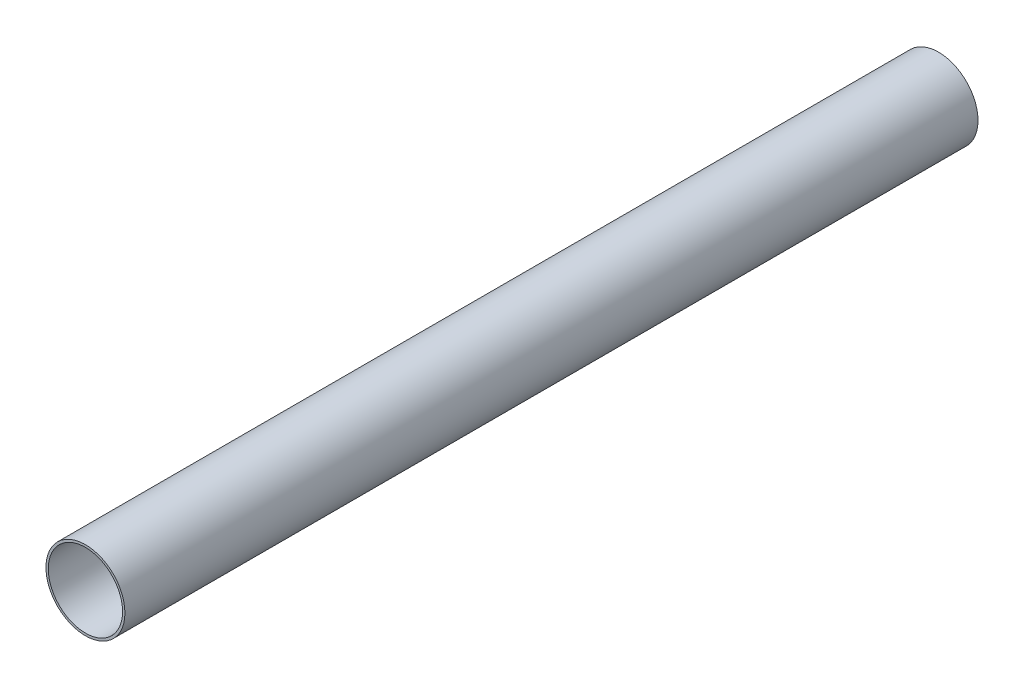
ISO-10303-21;
HEADER;
FILE_DESCRIPTION(('STEP AP214'),'2;1');
FILE_NAME('part.step','',(''),(''),'','','');
FILE_SCHEMA(('AUTOMOTIVE_DESIGN { 1 0 10303 214 1 1 1 1 }'));
ENDSEC;
DATA;
#1=APPLICATION_CONTEXT('core data for automotive mechanical design processes');
#2=APPLICATION_PROTOCOL_DEFINITION('international standard','automotive_design',2000,#1);
#3=PRODUCT_CONTEXT('',#1,'mechanical');
#4=PRODUCT('Part','Part','',(#3));
#5=PRODUCT_RELATED_PRODUCT_CATEGORY('part','',(#4));
#6=PRODUCT_DEFINITION_FORMATION('','',#4);
#7=PRODUCT_DEFINITION_CONTEXT('part definition',#1,'design');
#8=PRODUCT_DEFINITION('design','',#6,#7);
#9=PRODUCT_DEFINITION_SHAPE('','',#8);
#10=(LENGTH_UNIT() NAMED_UNIT(*) SI_UNIT(.MILLI.,.METRE.));
#11=(NAMED_UNIT(*) PLANE_ANGLE_UNIT() SI_UNIT($,.RADIAN.));
#12=(NAMED_UNIT(*) SI_UNIT($,.STERADIAN.) SOLID_ANGLE_UNIT());
#13=UNCERTAINTY_MEASURE_WITH_UNIT(LENGTH_MEASURE(1.E-05),#10,'distance_accuracy_value','');
#14=(GEOMETRIC_REPRESENTATION_CONTEXT(3) GLOBAL_UNCERTAINTY_ASSIGNED_CONTEXT((#13)) GLOBAL_UNIT_ASSIGNED_CONTEXT((#10,
#11,#12)) REPRESENTATION_CONTEXT('',''));
#15=CARTESIAN_POINT('',(0.,0.,0.));
#16=DIRECTION('',(0.,0.,1.));
#17=DIRECTION('',(1.,0.,0.));
#18=AXIS2_PLACEMENT_3D('',#15,#16,#17);
#19=CARTESIAN_POINT('',(0.,0.,5486.4));
#20=DIRECTION('',(0.,0.,1.));
#21=DIRECTION('',(1.,0.,0.));
#22=AXIS2_PLACEMENT_3D('',#19,#20,#21);
#23=PLANE('',#22);
#24=CARTESIAN_POINT('',(0.,0.,5486.4));
#25=DIRECTION('',(0.,0.,1.));
#26=DIRECTION('',(1.,0.,0.));
#27=AXIS2_PLACEMENT_3D('',#24,#25,#26);
#28=CIRCLE('',#27,254.);
#29=CARTESIAN_POINT('',(254.,0.,5486.4));
#30=VERTEX_POINT('',#29);
#31=EDGE_CURVE('E10',#30,#30,#28,.T.);
#32=ORIENTED_EDGE('',*,*,#31,.T.);
#33=EDGE_LOOP('',(#32));
#34=FACE_BOUND('',#33,.T.);
#35=CARTESIAN_POINT('',(0.,0.,5486.4));
#36=DIRECTION('',(0.,0.,1.));
#37=DIRECTION('',(1.,0.,0.));
#38=AXIS2_PLACEMENT_3D('',#35,#36,#37);
#39=CIRCLE('',#38,238.9124);
#40=CARTESIAN_POINT('',(238.9124,0.,5486.4));
#41=VERTEX_POINT('',#40);
#42=EDGE_CURVE('E39',#41,#41,#39,.T.);
#43=ORIENTED_EDGE('',*,*,#42,.F.);
#44=EDGE_LOOP('',(#43));
#45=FACE_BOUND('',#44,.T.);
#46=ADVANCED_FACE('F28',(#34,#45),#23,.T.);
#47=CARTESIAN_POINT('',(0.,0.,0.));
#48=DIRECTION('',(0.,0.,1.));
#49=DIRECTION('',(1.,0.,0.));
#50=AXIS2_PLACEMENT_3D('',#47,#48,#49);
#51=PLANE('',#50);
#52=CARTESIAN_POINT('',(0.,0.,0.));
#53=DIRECTION('',(0.,0.,1.));
#54=DIRECTION('',(1.,0.,0.));
#55=AXIS2_PLACEMENT_3D('',#52,#53,#54);
#56=CIRCLE('',#55,254.);
#57=CARTESIAN_POINT('',(254.,0.,0.));
#58=VERTEX_POINT('',#57);
#59=EDGE_CURVE('E32',#58,#58,#56,.T.);
#60=ORIENTED_EDGE('',*,*,#59,.F.);
#61=EDGE_LOOP('',(#60));
#62=FACE_BOUND('',#61,.T.);
#63=CARTESIAN_POINT('',(0.,0.,0.));
#64=DIRECTION('',(0.,0.,1.));
#65=DIRECTION('',(1.,0.,0.));
#66=AXIS2_PLACEMENT_3D('',#63,#64,#65);
#67=CIRCLE('',#66,238.9124);
#68=CARTESIAN_POINT('',(238.9124,0.,0.));
#69=VERTEX_POINT('',#68);
#70=EDGE_CURVE('E41',#69,#69,#67,.T.);
#71=ORIENTED_EDGE('',*,*,#70,.T.);
#72=EDGE_LOOP('',(#71));
#73=FACE_BOUND('',#72,.T.);
#74=ADVANCED_FACE('F51',(#62,#73),#51,.F.);
#75=CARTESIAN_POINT('',(0.,0.,5486.4));
#76=DIRECTION('',(0.,0.,-1.));
#77=DIRECTION('',(-1.,0.,0.));
#78=AXIS2_PLACEMENT_3D('',#75,#76,#77);
#79=CYLINDRICAL_SURFACE('',#78,254.);
#80=ORIENTED_EDGE('',*,*,#31,.F.);
#81=EDGE_LOOP('',(#80));
#82=FACE_BOUND('',#81,.T.);
#83=ORIENTED_EDGE('',*,*,#59,.T.);
#84=EDGE_LOOP('',(#83));
#85=FACE_BOUND('',#84,.T.);
#86=ADVANCED_FACE('F30',(#82,#85),#79,.T.);
#87=CARTESIAN_POINT('',(0.,0.,5486.4));
#88=DIRECTION('',(0.,0.,-1.));
#89=DIRECTION('',(-1.,0.,0.));
#90=AXIS2_PLACEMENT_3D('',#87,#88,#89);
#91=CYLINDRICAL_SURFACE('',#90,238.9124);
#92=ORIENTED_EDGE('',*,*,#42,.T.);
#93=EDGE_LOOP('',(#92));
#94=FACE_BOUND('',#93,.T.);
#95=ORIENTED_EDGE('',*,*,#70,.F.);
#96=EDGE_LOOP('',(#95));
#97=FACE_BOUND('',#96,.T.);
#98=ADVANCED_FACE('F47',(#94,#97),#91,.F.);
#99=CLOSED_SHELL('',(#46,#74,#86,#98));
#100=MANIFOLD_SOLID_BREP('B2',#99);
#101=ADVANCED_BREP_SHAPE_REPRESENTATION('',(#18,#100),#14);
#102=SHAPE_DEFINITION_REPRESENTATION(#9,#101);
ENDSEC;
END-ISO-10303-21;
